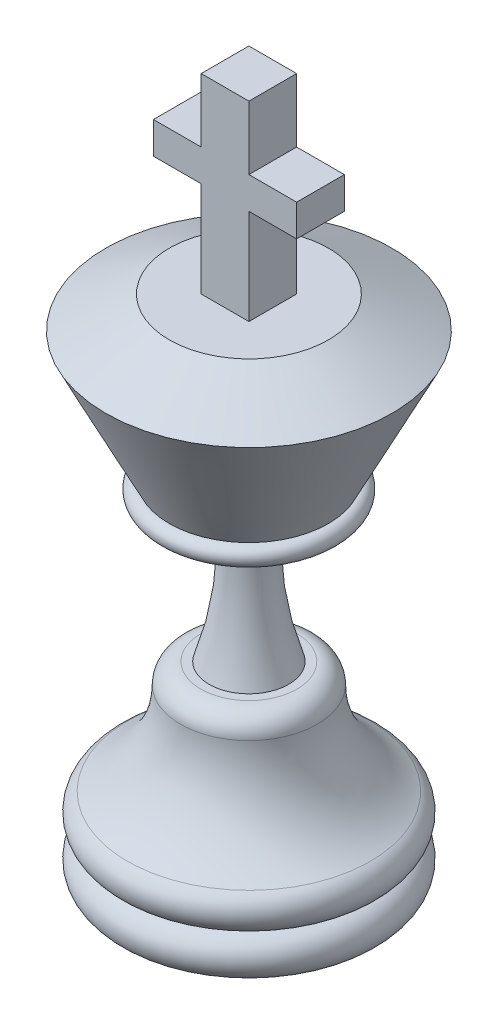
ISO-10303-21;
HEADER;
FILE_DESCRIPTION(('STEP AP214'),'2;1');
FILE_NAME('part.step','',(''),(''),'','','');
FILE_SCHEMA(('AUTOMOTIVE_DESIGN { 1 0 10303 214 1 1 1 1 }'));
ENDSEC;
DATA;
#1=APPLICATION_CONTEXT('core data for automotive mechanical design processes');
#2=APPLICATION_PROTOCOL_DEFINITION('international standard','automotive_design',2000,#1);
#3=PRODUCT_CONTEXT('',#1,'mechanical');
#4=PRODUCT('Part','Part','',(#3));
#5=PRODUCT_RELATED_PRODUCT_CATEGORY('part','',(#4));
#6=PRODUCT_DEFINITION_FORMATION('','',#4);
#7=PRODUCT_DEFINITION_CONTEXT('part definition',#1,'design');
#8=PRODUCT_DEFINITION('design','',#6,#7);
#9=PRODUCT_DEFINITION_SHAPE('','',#8);
#10=(LENGTH_UNIT() NAMED_UNIT(*) SI_UNIT(.MILLI.,.METRE.));
#11=(NAMED_UNIT(*) PLANE_ANGLE_UNIT() SI_UNIT($,.RADIAN.));
#12=(NAMED_UNIT(*) SI_UNIT($,.STERADIAN.) SOLID_ANGLE_UNIT());
#13=UNCERTAINTY_MEASURE_WITH_UNIT(LENGTH_MEASURE(1.E-05),#10,'distance_accuracy_value','');
#14=(GEOMETRIC_REPRESENTATION_CONTEXT(3) GLOBAL_UNCERTAINTY_ASSIGNED_CONTEXT((#13)) GLOBAL_UNIT_ASSIGNED_CONTEXT((#10,
#11,#12)) REPRESENTATION_CONTEXT('',''));
#15=CARTESIAN_POINT('',(0.,0.,0.));
#16=DIRECTION('',(0.,0.,1.));
#17=DIRECTION('',(1.,0.,0.));
#18=AXIS2_PLACEMENT_3D('',#15,#16,#17);
#19=CARTESIAN_POINT('',(0.,406.4,0.));
#20=DIRECTION('',(0.,-1.,0.));
#21=DIRECTION('',(0.,0.,-1.));
#22=AXIS2_PLACEMENT_3D('',#19,#20,#21);
#23=PLANE('',#22);
#24=CARTESIAN_POINT('',(0.,406.4,0.));
#25=DIRECTION('',(0.,1.,0.));
#26=DIRECTION('',(0.,0.,1.));
#27=AXIS2_PLACEMENT_3D('',#24,#25,#26);
#28=CIRCLE('',#27,63.5);
#29=CARTESIAN_POINT('',(0.,406.4,63.5));
#30=VERTEX_POINT('',#29);
#31=EDGE_CURVE('E146',#30,#30,#28,.T.);
#32=ORIENTED_EDGE('',*,*,#31,.T.);
#33=EDGE_LOOP('',(#32));
#34=FACE_BOUND('',#33,.T.);
#35=DIRECTION('',(1.,0.,0.));
#36=VECTOR('',#35,1.);
#37=CARTESIAN_POINT('',(-19.05,406.4,-19.05));
#38=LINE('',#37,#36);
#39=CARTESIAN_POINT('',(-19.05,406.4,-19.05));
#40=VERTEX_POINT('',#39);
#41=CARTESIAN_POINT('',(19.05,406.4,-19.05));
#42=VERTEX_POINT('',#41);
#43=EDGE_CURVE('E53',#40,#42,#38,.T.);
#44=ORIENTED_EDGE('',*,*,#43,.T.);
#45=DIRECTION('',(0.,0.,1.));
#46=VECTOR('',#45,1.);
#47=CARTESIAN_POINT('',(19.05,406.4,-19.05));
#48=LINE('',#47,#46);
#49=CARTESIAN_POINT('',(19.05,406.4,19.05));
#50=VERTEX_POINT('',#49);
#51=EDGE_CURVE('E126',#42,#50,#48,.T.);
#52=ORIENTED_EDGE('',*,*,#51,.T.);
#53=DIRECTION('',(1.,0.,0.));
#54=VECTOR('',#53,1.);
#55=CARTESIAN_POINT('',(-19.05,406.4,19.05));
#56=LINE('',#55,#54);
#57=CARTESIAN_POINT('',(-19.05,406.4,19.05));
#58=VERTEX_POINT('',#57);
#59=EDGE_CURVE('E131',#58,#50,#56,.T.);
#60=ORIENTED_EDGE('',*,*,#59,.F.);
#61=DIRECTION('',(0.,0.,1.));
#62=VECTOR('',#61,1.);
#63=CARTESIAN_POINT('',(-19.05,406.4,-19.05));
#64=LINE('',#63,#62);
#65=EDGE_CURVE('E150',#40,#58,#64,.T.);
#66=ORIENTED_EDGE('',*,*,#65,.F.);
#67=EDGE_LOOP('',(#44,#52,#60,#66));
#68=FACE_BOUND('',#67,.T.);
#69=ADVANCED_FACE('F30',(#34,#68),#23,.F.);
#70=CARTESIAN_POINT('',(0.,152.4,0.));
#71=DIRECTION('',(0.,1.,0.));
#72=DIRECTION('',(0.,0.,1.));
#73=AXIS2_PLACEMENT_3D('',#70,#71,#72);
#74=PLANE('',#73);
#75=CARTESIAN_POINT('',(0.,152.4,0.));
#76=DIRECTION('',(0.,-1.,0.));
#77=DIRECTION('',(0.,0.,-1.));
#78=AXIS2_PLACEMENT_3D('',#75,#76,#77);
#79=CIRCLE('',#78,31.7499999999999);
#80=CARTESIAN_POINT('',(0.,152.4,-31.7499999999999));
#81=VERTEX_POINT('',#80);
#82=EDGE_CURVE('E11',#81,#81,#79,.F.);
#83=ORIENTED_EDGE('',*,*,#82,.F.);
#84=EDGE_LOOP('',(#83));
#85=FACE_BOUND('',#84,.T.);
#86=CARTESIAN_POINT('',(0.,152.4,0.));
#87=DIRECTION('',(0.,-1.,0.));
#88=DIRECTION('',(0.,0.,-1.));
#89=AXIS2_PLACEMENT_3D('',#86,#87,#88);
#90=CIRCLE('',#89,38.350818771168);
#91=CARTESIAN_POINT('',(0.,152.4,-38.350818771168));
#92=VERTEX_POINT('',#91);
#93=EDGE_CURVE('E38',#92,#92,#90,.T.);
#94=ORIENTED_EDGE('',*,*,#93,.F.);
#95=EDGE_LOOP('',(#94));
#96=FACE_BOUND('',#95,.T.);
#97=ADVANCED_FACE('F32',(#85,#96),#74,.T.);
#98=CARTESIAN_POINT('',(0.,136.188437542336,0.));
#99=DIRECTION('',(0.,-1.,0.));
#100=DIRECTION('',(0.,0.,-1.));
#101=AXIS2_PLACEMENT_3D('',#98,#99,#100);
#102=TOROIDAL_SURFACE('',#101,38.350818771168,16.211562457664);
#103=ORIENTED_EDGE('',*,*,#93,.T.);
#104=EDGE_LOOP('',(#103));
#105=FACE_BOUND('',#104,.T.);
#106=CARTESIAN_POINT('',(0.,136.188437542336,0.));
#107=DIRECTION('',(0.,-1.,0.));
#108=DIRECTION('',(0.,0.,-1.));
#109=AXIS2_PLACEMENT_3D('',#106,#107,#108);
#110=CIRCLE('',#109,54.562381228832);
#111=CARTESIAN_POINT('',(0.,136.188437542336,-54.562381228832));
#112=VERTEX_POINT('',#111);
#113=EDGE_CURVE('E171',#112,#112,#110,.T.);
#114=ORIENTED_EDGE('',*,*,#113,.F.);
#115=EDGE_LOOP('',(#114));
#116=FACE_BOUND('',#115,.T.);
#117=ADVANCED_FACE('F176',(#105,#116),#102,.T.);
#118=CARTESIAN_POINT('',(0.,136.188437542336,0.));
#119=DIRECTION('',(0.,-1.,0.));
#120=DIRECTION('',(0.,0.,-1.));
#121=AXIS2_PLACEMENT_3D('',#118,#119,#120);
#122=TOROIDAL_SURFACE('',#121,139.449181228832,84.8868);
#123=ORIENTED_EDGE('',*,*,#113,.T.);
#124=EDGE_LOOP('',(#123));
#125=FACE_BOUND('',#124,.T.);
#126=CARTESIAN_POINT('',(0.,62.6743122963664,0.));
#127=DIRECTION('',(0.,-1.,0.));
#128=DIRECTION('',(0.,0.,-1.));
#129=AXIS2_PLACEMENT_3D('',#126,#127,#128);
#130=CIRCLE('',#129,97.0057812288332);
#131=CARTESIAN_POINT('',(0.,62.6743122963664,-97.0057812288332));
#132=VERTEX_POINT('',#131);
#133=EDGE_CURVE('E168',#132,#132,#130,.T.);
#134=ORIENTED_EDGE('',*,*,#133,.F.);
#135=EDGE_LOOP('',(#134));
#136=FACE_BOUND('',#135,.T.);
#137=ADVANCED_FACE('F185',(#125,#136),#122,.F.);
#138=CARTESIAN_POINT('',(0.,48.634687372992,0.));
#139=DIRECTION('',(0.,-1.,0.));
#140=DIRECTION('',(0.,0.,-1.));
#141=AXIS2_PLACEMENT_3D('',#138,#139,#140);
#142=TOROIDAL_SURFACE('',#141,88.9,16.211562457664);
#143=ORIENTED_EDGE('',*,*,#133,.T.);
#144=EDGE_LOOP('',(#143));
#145=FACE_BOUND('',#144,.T.);
#146=CARTESIAN_POINT('',(0.,32.423124915328,0.));
#147=DIRECTION('',(0.,-1.,0.));
#148=DIRECTION('',(0.,0.,-1.));
#149=AXIS2_PLACEMENT_3D('',#146,#147,#148);
#150=CIRCLE('',#149,88.9);
#151=CARTESIAN_POINT('',(0.,32.423124915328,-88.9));
#152=VERTEX_POINT('',#151);
#153=EDGE_CURVE('E165',#152,#152,#150,.T.);
#154=ORIENTED_EDGE('',*,*,#153,.F.);
#155=EDGE_LOOP('',(#154));
#156=FACE_BOUND('',#155,.T.);
#157=ADVANCED_FACE('F210',(#145,#156),#142,.T.);
#158=CARTESIAN_POINT('',(0.,16.211562457664,0.));
#159=DIRECTION('',(0.,-1.,0.));
#160=DIRECTION('',(0.,0.,-1.));
#161=AXIS2_PLACEMENT_3D('',#158,#159,#160);
#162=TOROIDAL_SURFACE('',#161,88.9,16.211562457664);
#163=ORIENTED_EDGE('',*,*,#153,.T.);
#164=EDGE_LOOP('',(#163));
#165=FACE_BOUND('',#164,.T.);
#166=CARTESIAN_POINT('',(0.,0.,0.));
#167=DIRECTION('',(0.,-1.,0.));
#168=DIRECTION('',(0.,0.,-1.));
#169=AXIS2_PLACEMENT_3D('',#166,#167,#168);
#170=CIRCLE('',#169,88.9);
#171=CARTESIAN_POINT('',(0.,0.,-88.9));
#172=VERTEX_POINT('',#171);
#173=EDGE_CURVE('E162',#172,#172,#170,.T.);
#174=ORIENTED_EDGE('',*,*,#173,.F.);
#175=EDGE_LOOP('',(#174));
#176=FACE_BOUND('',#175,.T.);
#177=ADVANCED_FACE('F203',(#165,#176),#162,.T.);
#178=CARTESIAN_POINT('',(0.,0.,0.));
#179=DIRECTION('',(0.,-1.,0.));
#180=DIRECTION('',(0.,0.,-1.));
#181=AXIS2_PLACEMENT_3D('',#178,#179,#180);
#182=PLANE('',#181);
#183=ORIENTED_EDGE('',*,*,#173,.T.);
#184=EDGE_LOOP('',(#183));
#185=FACE_BOUND('',#184,.T.);
#186=ADVANCED_FACE('F193',(#185),#182,.T.);
#187=CARTESIAN_POINT('',(0.,234.043312784872,0.));
#188=DIRECTION('',(0.,-1.,0.));
#189=DIRECTION('',(0.,0.,-1.));
#190=AXIS2_PLACEMENT_3D('',#187,#188,#189);
#191=TOROIDAL_SURFACE('',#190,272.271037494668,254.);
#192=CARTESIAN_POINT('',(0.,253.920590519107,0.));
#193=DIRECTION('',(0.,-1.,0.));
#194=DIRECTION('',(0.,0.,-1.));
#195=AXIS2_PLACEMENT_3D('',#192,#193,#194);
#196=CIRCLE('',#195,19.05);
#197=CARTESIAN_POINT('',(0.,253.920590519107,-19.05));
#198=VERTEX_POINT('',#197);
#199=EDGE_CURVE('E159',#198,#198,#196,.T.);
#200=ORIENTED_EDGE('',*,*,#199,.T.);
#201=EDGE_LOOP('',(#200));
#202=FACE_BOUND('',#201,.T.);
#203=ORIENTED_EDGE('',*,*,#82,.T.);
#204=EDGE_LOOP('',(#203));
#205=FACE_BOUND('',#204,.T.);
#206=ADVANCED_FACE('F190',(#202,#205),#191,.F.);
#207=CARTESIAN_POINT('',(0.,162.56,0.));
#208=DIRECTION('',(0.,-1.,0.));
#209=DIRECTION('',(0.,0.,-1.));
#210=AXIS2_PLACEMENT_3D('',#207,#208,#209);
#211=DEGENERATE_TOROIDAL_SURFACE('',#210,63.5,101.6,.T.);
#212=CARTESIAN_POINT('',(0.,264.16,0.));
#213=DIRECTION('',(0.,-1.,0.));
#214=DIRECTION('',(0.,0.,-1.));
#215=AXIS2_PLACEMENT_3D('',#212,#213,#214);
#216=CIRCLE('',#215,63.5);
#217=CARTESIAN_POINT('',(0.,264.16,-63.5));
#218=VERTEX_POINT('',#217);
#219=EDGE_CURVE('E156',#218,#218,#216,.T.);
#220=ORIENTED_EDGE('',*,*,#219,.T.);
#221=EDGE_LOOP('',(#220));
#222=FACE_BOUND('',#221,.T.);
#223=ORIENTED_EDGE('',*,*,#199,.F.);
#224=EDGE_LOOP('',(#223));
#225=FACE_BOUND('',#224,.T.);
#226=ADVANCED_FACE('F192',(#222,#225),#211,.F.);
#227=CARTESIAN_POINT('',(0.,271.78,0.));
#228=DIRECTION('',(0.,-1.,0.));
#229=DIRECTION('',(0.,0.,-1.));
#230=AXIS2_PLACEMENT_3D('',#227,#228,#229);
#231=TOROIDAL_SURFACE('',#230,63.5,7.62000000000004);
#232=CARTESIAN_POINT('',(0.,279.4,0.));
#233=DIRECTION('',(0.,1.,0.));
#234=DIRECTION('',(0.,0.,1.));
#235=AXIS2_PLACEMENT_3D('',#232,#233,#234);
#236=CIRCLE('',#235,63.5);
#237=CARTESIAN_POINT('',(0.,279.4,63.5));
#238=VERTEX_POINT('',#237);
#239=EDGE_CURVE('E153',#238,#238,#236,.T.);
#240=ORIENTED_EDGE('',*,*,#239,.F.);
#241=EDGE_LOOP('',(#240));
#242=FACE_BOUND('',#241,.T.);
#243=ORIENTED_EDGE('',*,*,#219,.F.);
#244=EDGE_LOOP('',(#243));
#245=FACE_BOUND('',#244,.T.);
#246=ADVANCED_FACE('F200',(#242,#245),#231,.T.);
#247=CARTESIAN_POINT('',(0.,279.4,0.));
#248=DIRECTION('',(0.,1.,0.));
#249=DIRECTION('',(0.,0.,1.));
#250=AXIS2_PLACEMENT_3D('',#247,#248,#249);
#251=CONICAL_SURFACE('',#250,63.5,0.463647609000807);
#252=CARTESIAN_POINT('',(0.,381.,0.));
#253=DIRECTION('',(0.,1.,0.));
#254=DIRECTION('',(0.,0.,1.));
#255=AXIS2_PLACEMENT_3D('',#252,#253,#254);
#256=CIRCLE('',#255,114.3);
#257=CARTESIAN_POINT('',(0.,381.,114.3));
#258=VERTEX_POINT('',#257);
#259=EDGE_CURVE('E149',#258,#258,#256,.T.);
#260=ORIENTED_EDGE('',*,*,#259,.F.);
#261=EDGE_LOOP('',(#260));
#262=FACE_BOUND('',#261,.T.);
#263=ORIENTED_EDGE('',*,*,#239,.T.);
#264=EDGE_LOOP('',(#263));
#265=FACE_BOUND('',#264,.T.);
#266=ADVANCED_FACE('F264',(#262,#265),#251,.T.);
#267=CARTESIAN_POINT('',(0.,381.,0.));
#268=DIRECTION('',(0.,-1.,0.));
#269=DIRECTION('',(0.,0.,-1.));
#270=AXIS2_PLACEMENT_3D('',#267,#268,#269);
#271=CONICAL_SURFACE('',#270,114.3,1.10714871779409);
#272=ORIENTED_EDGE('',*,*,#31,.F.);
#273=EDGE_LOOP('',(#272));
#274=FACE_BOUND('',#273,.T.);
#275=ORIENTED_EDGE('',*,*,#259,.T.);
#276=EDGE_LOOP('',(#275));
#277=FACE_BOUND('',#276,.T.);
#278=ADVANCED_FACE('F273',(#274,#277),#271,.T.);
#279=CARTESIAN_POINT('',(-19.05,406.4,-19.05));
#280=DIRECTION('',(-1.,0.,0.));
#281=DIRECTION('',(0.,-1.,0.));
#282=AXIS2_PLACEMENT_3D('',#279,#280,#281);
#283=PLANE('',#282);
#284=ORIENTED_EDGE('',*,*,#65,.T.);
#285=DIRECTION('',(0.,-1.,0.));
#286=VECTOR('',#285,1.);
#287=CARTESIAN_POINT('',(-19.05,406.4,19.05));
#288=LINE('',#287,#286);
#289=CARTESIAN_POINT('',(-19.05,482.6,19.05));
#290=VERTEX_POINT('',#289);
#291=EDGE_CURVE('E45',#290,#58,#288,.T.);
#292=ORIENTED_EDGE('',*,*,#291,.F.);
#293=DIRECTION('',(0.,0.,1.));
#294=VECTOR('',#293,1.);
#295=CARTESIAN_POINT('',(-19.05,482.6,-19.05));
#296=LINE('',#295,#294);
#297=CARTESIAN_POINT('',(-19.05,482.6,-19.05));
#298=VERTEX_POINT('',#297);
#299=EDGE_CURVE('E479',#298,#290,#296,.T.);
#300=ORIENTED_EDGE('',*,*,#299,.F.);
#301=DIRECTION('',(0.,-1.,0.));
#302=VECTOR('',#301,1.);
#303=CARTESIAN_POINT('',(-19.05,406.4,-19.05));
#304=LINE('',#303,#302);
#305=EDGE_CURVE('E138',#298,#40,#304,.T.);
#306=ORIENTED_EDGE('',*,*,#305,.T.);
#307=EDGE_LOOP('',(#284,#292,#300,#306));
#308=FACE_BOUND('',#307,.T.);
#309=ADVANCED_FACE('F283',(#308),#283,.T.);
#310=CARTESIAN_POINT('',(-19.05,482.6,-19.05));
#311=DIRECTION('',(0.,-1.,0.));
#312=DIRECTION('',(1.,0.,0.));
#313=AXIS2_PLACEMENT_3D('',#310,#311,#312);
#314=PLANE('',#313);
#315=ORIENTED_EDGE('',*,*,#299,.T.);
#316=DIRECTION('',(1.,0.,0.));
#317=VECTOR('',#316,1.);
#318=CARTESIAN_POINT('',(-19.05,482.6,19.05));
#319=LINE('',#318,#317);
#320=CARTESIAN_POINT('',(-57.15,482.6,19.05));
#321=VERTEX_POINT('',#320);
#322=EDGE_CURVE('E449',#321,#290,#319,.T.);
#323=ORIENTED_EDGE('',*,*,#322,.F.);
#324=DIRECTION('',(0.,0.,1.));
#325=VECTOR('',#324,1.);
#326=CARTESIAN_POINT('',(-57.15,482.6,-19.05));
#327=LINE('',#326,#325);
#328=CARTESIAN_POINT('',(-57.15,482.6,-19.05));
#329=VERTEX_POINT('',#328);
#330=EDGE_CURVE('E481',#329,#321,#327,.T.);
#331=ORIENTED_EDGE('',*,*,#330,.F.);
#332=DIRECTION('',(1.,0.,0.));
#333=VECTOR('',#332,1.);
#334=CARTESIAN_POINT('',(-19.05,482.6,-19.05));
#335=LINE('',#334,#333);
#336=EDGE_CURVE('E142',#329,#298,#335,.T.);
#337=ORIENTED_EDGE('',*,*,#336,.T.);
#338=EDGE_LOOP('',(#315,#323,#331,#337));
#339=FACE_BOUND('',#338,.T.);
#340=ADVANCED_FACE('F299',(#339),#314,.T.);
#341=CARTESIAN_POINT('',(-57.15,482.6,-19.05));
#342=DIRECTION('',(-1.,0.,0.));
#343=DIRECTION('',(0.,-1.,0.));
#344=AXIS2_PLACEMENT_3D('',#341,#342,#343);
#345=PLANE('',#344);
#346=ORIENTED_EDGE('',*,*,#330,.T.);
#347=DIRECTION('',(0.,-1.,0.));
#348=VECTOR('',#347,1.);
#349=CARTESIAN_POINT('',(-57.15,482.6,19.05));
#350=LINE('',#349,#348);
#351=CARTESIAN_POINT('',(-57.15,508.,19.05));
#352=VERTEX_POINT('',#351);
#353=EDGE_CURVE('E446',#352,#321,#350,.T.);
#354=ORIENTED_EDGE('',*,*,#353,.F.);
#355=DIRECTION('',(0.,0.,1.));
#356=VECTOR('',#355,1.);
#357=CARTESIAN_POINT('',(-57.15,508.,-19.05));
#358=LINE('',#357,#356);
#359=CARTESIAN_POINT('',(-57.15,508.,-19.05));
#360=VERTEX_POINT('',#359);
#361=EDGE_CURVE('E483',#360,#352,#358,.T.);
#362=ORIENTED_EDGE('',*,*,#361,.F.);
#363=DIRECTION('',(0.,-1.,0.));
#364=VECTOR('',#363,1.);
#365=CARTESIAN_POINT('',(-57.15,482.6,-19.05));
#366=LINE('',#365,#364);
#367=EDGE_CURVE('E473',#360,#329,#366,.T.);
#368=ORIENTED_EDGE('',*,*,#367,.T.);
#369=EDGE_LOOP('',(#346,#354,#362,#368));
#370=FACE_BOUND('',#369,.T.);
#371=ADVANCED_FACE('F309',(#370),#345,.T.);
#372=CARTESIAN_POINT('',(-57.15,508.,-19.05));
#373=DIRECTION('',(0.,1.,0.));
#374=DIRECTION('',(0.,0.,1.));
#375=AXIS2_PLACEMENT_3D('',#372,#373,#374);
#376=PLANE('',#375);
#377=ORIENTED_EDGE('',*,*,#361,.T.);
#378=DIRECTION('',(-1.,0.,0.));
#379=VECTOR('',#378,1.);
#380=CARTESIAN_POINT('',(-57.15,508.,19.05));
#381=LINE('',#380,#379);
#382=CARTESIAN_POINT('',(-19.05,508.,19.05));
#383=VERTEX_POINT('',#382);
#384=EDGE_CURVE('E443',#383,#352,#381,.T.);
#385=ORIENTED_EDGE('',*,*,#384,.F.);
#386=DIRECTION('',(0.,0.,1.));
#387=VECTOR('',#386,1.);
#388=CARTESIAN_POINT('',(-19.05,508.,-19.05));
#389=LINE('',#388,#387);
#390=CARTESIAN_POINT('',(-19.05,508.,-19.05));
#391=VERTEX_POINT('',#390);
#392=EDGE_CURVE('E485',#391,#383,#389,.T.);
#393=ORIENTED_EDGE('',*,*,#392,.F.);
#394=DIRECTION('',(-1.,0.,0.));
#395=VECTOR('',#394,1.);
#396=CARTESIAN_POINT('',(-57.15,508.,-19.05));
#397=LINE('',#396,#395);
#398=EDGE_CURVE('E470',#391,#360,#397,.T.);
#399=ORIENTED_EDGE('',*,*,#398,.T.);
#400=EDGE_LOOP('',(#377,#385,#393,#399));
#401=FACE_BOUND('',#400,.T.);
#402=ADVANCED_FACE('F319',(#401),#376,.T.);
#403=CARTESIAN_POINT('',(-19.05,508.,-19.05));
#404=DIRECTION('',(-1.,0.,0.));
#405=DIRECTION('',(0.,-1.,0.));
#406=AXIS2_PLACEMENT_3D('',#403,#404,#405);
#407=PLANE('',#406);
#408=ORIENTED_EDGE('',*,*,#392,.T.);
#409=DIRECTION('',(0.,-1.,0.));
#410=VECTOR('',#409,1.);
#411=CARTESIAN_POINT('',(-19.05,508.,19.05));
#412=LINE('',#411,#410);
#413=CARTESIAN_POINT('',(-19.05,558.8,19.05));
#414=VERTEX_POINT('',#413);
#415=EDGE_CURVE('E440',#414,#383,#412,.T.);
#416=ORIENTED_EDGE('',*,*,#415,.F.);
#417=DIRECTION('',(0.,0.,1.));
#418=VECTOR('',#417,1.);
#419=CARTESIAN_POINT('',(-19.05,558.8,-19.05));
#420=LINE('',#419,#418);
#421=CARTESIAN_POINT('',(-19.05,558.8,-19.05));
#422=VERTEX_POINT('',#421);
#423=EDGE_CURVE('E487',#422,#414,#420,.T.);
#424=ORIENTED_EDGE('',*,*,#423,.F.);
#425=DIRECTION('',(0.,-1.,0.));
#426=VECTOR('',#425,1.);
#427=CARTESIAN_POINT('',(-19.05,508.,-19.05));
#428=LINE('',#427,#426);
#429=EDGE_CURVE('E467',#422,#391,#428,.T.);
#430=ORIENTED_EDGE('',*,*,#429,.T.);
#431=EDGE_LOOP('',(#408,#416,#424,#430));
#432=FACE_BOUND('',#431,.T.);
#433=ADVANCED_FACE('F329',(#432),#407,.T.);
#434=CARTESIAN_POINT('',(19.05,558.8,-19.05));
#435=DIRECTION('',(0.,1.,0.));
#436=DIRECTION('',(0.,0.,1.));
#437=AXIS2_PLACEMENT_3D('',#434,#435,#436);
#438=PLANE('',#437);
#439=ORIENTED_EDGE('',*,*,#423,.T.);
#440=DIRECTION('',(-1.,0.,0.));
#441=VECTOR('',#440,1.);
#442=CARTESIAN_POINT('',(19.05,558.8,19.05));
#443=LINE('',#442,#441);
#444=CARTESIAN_POINT('',(19.05,558.8,19.05));
#445=VERTEX_POINT('',#444);
#446=EDGE_CURVE('E437',#445,#414,#443,.T.);
#447=ORIENTED_EDGE('',*,*,#446,.F.);
#448=DIRECTION('',(0.,0.,1.));
#449=VECTOR('',#448,1.);
#450=CARTESIAN_POINT('',(19.05,558.8,-19.05));
#451=LINE('',#450,#449);
#452=CARTESIAN_POINT('',(19.05,558.8,-19.05));
#453=VERTEX_POINT('',#452);
#454=EDGE_CURVE('E489',#453,#445,#451,.T.);
#455=ORIENTED_EDGE('',*,*,#454,.F.);
#456=DIRECTION('',(-1.,0.,0.));
#457=VECTOR('',#456,1.);
#458=CARTESIAN_POINT('',(19.05,558.8,-19.05));
#459=LINE('',#458,#457);
#460=EDGE_CURVE('E464',#453,#422,#459,.T.);
#461=ORIENTED_EDGE('',*,*,#460,.T.);
#462=EDGE_LOOP('',(#439,#447,#455,#461));
#463=FACE_BOUND('',#462,.T.);
#464=ADVANCED_FACE('F339',(#463),#438,.T.);
#465=CARTESIAN_POINT('',(19.05,508.,-19.05));
#466=DIRECTION('',(1.,0.,0.));
#467=DIRECTION('',(0.,0.,-1.));
#468=AXIS2_PLACEMENT_3D('',#465,#466,#467);
#469=PLANE('',#468);
#470=ORIENTED_EDGE('',*,*,#454,.T.);
#471=DIRECTION('',(0.,1.,0.));
#472=VECTOR('',#471,1.);
#473=CARTESIAN_POINT('',(19.05,508.,19.05));
#474=LINE('',#473,#472);
#475=CARTESIAN_POINT('',(19.05,508.,19.05));
#476=VERTEX_POINT('',#475);
#477=EDGE_CURVE('E432',#476,#445,#474,.T.);
#478=ORIENTED_EDGE('',*,*,#477,.F.);
#479=DIRECTION('',(0.,0.,1.));
#480=VECTOR('',#479,1.);
#481=CARTESIAN_POINT('',(19.05,508.,-19.05));
#482=LINE('',#481,#480);
#483=CARTESIAN_POINT('',(19.05,508.,-19.05));
#484=VERTEX_POINT('',#483);
#485=EDGE_CURVE('E491',#484,#476,#482,.T.);
#486=ORIENTED_EDGE('',*,*,#485,.F.);
#487=DIRECTION('',(0.,1.,0.));
#488=VECTOR('',#487,1.);
#489=CARTESIAN_POINT('',(19.05,508.,-19.05));
#490=LINE('',#489,#488);
#491=EDGE_CURVE('E461',#484,#453,#490,.T.);
#492=ORIENTED_EDGE('',*,*,#491,.T.);
#493=EDGE_LOOP('',(#470,#478,#486,#492));
#494=FACE_BOUND('',#493,.T.);
#495=ADVANCED_FACE('F349',(#494),#469,.T.);
#496=CARTESIAN_POINT('',(57.15,508.,-19.05));
#497=DIRECTION('',(0.,1.,0.));
#498=DIRECTION('',(0.,0.,1.));
#499=AXIS2_PLACEMENT_3D('',#496,#497,#498);
#500=PLANE('',#499);
#501=ORIENTED_EDGE('',*,*,#485,.T.);
#502=DIRECTION('',(-1.,0.,0.));
#503=VECTOR('',#502,1.);
#504=CARTESIAN_POINT('',(57.15,508.,19.05));
#505=LINE('',#504,#503);
#506=CARTESIAN_POINT('',(57.15,508.,19.05));
#507=VERTEX_POINT('',#506);
#508=EDGE_CURVE('E430',#507,#476,#505,.T.);
#509=ORIENTED_EDGE('',*,*,#508,.F.);
#510=DIRECTION('',(0.,0.,1.));
#511=VECTOR('',#510,1.);
#512=CARTESIAN_POINT('',(57.15,508.,-19.05));
#513=LINE('',#512,#511);
#514=CARTESIAN_POINT('',(57.15,508.,-19.05));
#515=VERTEX_POINT('',#514);
#516=EDGE_CURVE('E424',#515,#507,#513,.T.);
#517=ORIENTED_EDGE('',*,*,#516,.F.);
#518=DIRECTION('',(-1.,0.,0.));
#519=VECTOR('',#518,1.);
#520=CARTESIAN_POINT('',(57.15,508.,-19.05));
#521=LINE('',#520,#519);
#522=EDGE_CURVE('E458',#515,#484,#521,.T.);
#523=ORIENTED_EDGE('',*,*,#522,.T.);
#524=EDGE_LOOP('',(#501,#509,#517,#523));
#525=FACE_BOUND('',#524,.T.);
#526=ADVANCED_FACE('F359',(#525),#500,.T.);
#527=CARTESIAN_POINT('',(57.15,482.6,-19.05));
#528=DIRECTION('',(1.,0.,0.));
#529=DIRECTION('',(0.,0.,-1.));
#530=AXIS2_PLACEMENT_3D('',#527,#528,#529);
#531=PLANE('',#530);
#532=ORIENTED_EDGE('',*,*,#516,.T.);
#533=DIRECTION('',(0.,1.,0.));
#534=VECTOR('',#533,1.);
#535=CARTESIAN_POINT('',(57.15,482.6,19.05));
#536=LINE('',#535,#534);
#537=CARTESIAN_POINT('',(57.15,482.6,19.05));
#538=VERTEX_POINT('',#537);
#539=EDGE_CURVE('E427',#538,#507,#536,.T.);
#540=ORIENTED_EDGE('',*,*,#539,.F.);
#541=DIRECTION('',(0.,0.,1.));
#542=VECTOR('',#541,1.);
#543=CARTESIAN_POINT('',(57.15,482.6,-19.05));
#544=LINE('',#543,#542);
#545=CARTESIAN_POINT('',(57.15,482.6,-19.05));
#546=VERTEX_POINT('',#545);
#547=EDGE_CURVE('E140',#546,#538,#544,.T.);
#548=ORIENTED_EDGE('',*,*,#547,.F.);
#549=DIRECTION('',(0.,1.,0.));
#550=VECTOR('',#549,1.);
#551=CARTESIAN_POINT('',(57.15,482.6,-19.05));
#552=LINE('',#551,#550);
#553=EDGE_CURVE('E456',#546,#515,#552,.T.);
#554=ORIENTED_EDGE('',*,*,#553,.T.);
#555=EDGE_LOOP('',(#532,#540,#548,#554));
#556=FACE_BOUND('',#555,.T.);
#557=ADVANCED_FACE('F369',(#556),#531,.T.);
#558=CARTESIAN_POINT('',(19.05,482.6,-19.05));
#559=DIRECTION('',(0.,-1.,0.));
#560=DIRECTION('',(0.,0.,-1.));
#561=AXIS2_PLACEMENT_3D('',#558,#559,#560);
#562=PLANE('',#561);
#563=ORIENTED_EDGE('',*,*,#547,.T.);
#564=DIRECTION('',(1.,0.,0.));
#565=VECTOR('',#564,1.);
#566=CARTESIAN_POINT('',(19.05,482.6,19.05));
#567=LINE('',#566,#565);
#568=CARTESIAN_POINT('',(19.05,482.6,19.05));
#569=VERTEX_POINT('',#568);
#570=EDGE_CURVE('E130',#569,#538,#567,.T.);
#571=ORIENTED_EDGE('',*,*,#570,.F.);
#572=DIRECTION('',(0.,0.,1.));
#573=VECTOR('',#572,1.);
#574=CARTESIAN_POINT('',(19.05,482.6,-19.05));
#575=LINE('',#574,#573);
#576=CARTESIAN_POINT('',(19.05,482.6,-19.05));
#577=VERTEX_POINT('',#576);
#578=EDGE_CURVE('E127',#577,#569,#575,.T.);
#579=ORIENTED_EDGE('',*,*,#578,.F.);
#580=DIRECTION('',(1.,0.,0.));
#581=VECTOR('',#580,1.);
#582=CARTESIAN_POINT('',(19.05,482.6,-19.05));
#583=LINE('',#582,#581);
#584=EDGE_CURVE('E420',#577,#546,#583,.T.);
#585=ORIENTED_EDGE('',*,*,#584,.T.);
#586=EDGE_LOOP('',(#563,#571,#579,#585));
#587=FACE_BOUND('',#586,.T.);
#588=ADVANCED_FACE('F379',(#587),#562,.T.);
#589=CARTESIAN_POINT('',(19.05,406.4,-19.05));
#590=DIRECTION('',(1.,0.,0.));
#591=DIRECTION('',(0.,0.,-1.));
#592=AXIS2_PLACEMENT_3D('',#589,#590,#591);
#593=PLANE('',#592);
#594=ORIENTED_EDGE('',*,*,#578,.T.);
#595=DIRECTION('',(0.,1.,0.));
#596=VECTOR('',#595,1.);
#597=CARTESIAN_POINT('',(19.05,406.4,19.05));
#598=LINE('',#597,#596);
#599=EDGE_CURVE('E122',#50,#569,#598,.T.);
#600=ORIENTED_EDGE('',*,*,#599,.F.);
#601=ORIENTED_EDGE('',*,*,#51,.F.);
#602=DIRECTION('',(0.,1.,0.));
#603=VECTOR('',#602,1.);
#604=CARTESIAN_POINT('',(19.05,406.4,-19.05));
#605=LINE('',#604,#603);
#606=EDGE_CURVE('E453',#42,#577,#605,.T.);
#607=ORIENTED_EDGE('',*,*,#606,.T.);
#608=EDGE_LOOP('',(#594,#600,#601,#607));
#609=FACE_BOUND('',#608,.T.);
#610=ADVANCED_FACE('F123',(#609),#593,.T.);
#611=CARTESIAN_POINT('',(19.05,406.4,-19.05));
#612=DIRECTION('',(0.,0.,1.));
#613=DIRECTION('',(1.,0.,0.));
#614=AXIS2_PLACEMENT_3D('',#611,#612,#613);
#615=PLANE('',#614);
#616=ORIENTED_EDGE('',*,*,#43,.F.);
#617=ORIENTED_EDGE('',*,*,#305,.F.);
#618=ORIENTED_EDGE('',*,*,#336,.F.);
#619=ORIENTED_EDGE('',*,*,#367,.F.);
#620=ORIENTED_EDGE('',*,*,#398,.F.);
#621=ORIENTED_EDGE('',*,*,#429,.F.);
#622=ORIENTED_EDGE('',*,*,#460,.F.);
#623=ORIENTED_EDGE('',*,*,#491,.F.);
#624=ORIENTED_EDGE('',*,*,#522,.F.);
#625=ORIENTED_EDGE('',*,*,#553,.F.);
#626=ORIENTED_EDGE('',*,*,#584,.F.);
#627=ORIENTED_EDGE('',*,*,#606,.F.);
#628=EDGE_LOOP('',(#616,#617,#618,#619,#620,#621,#622,#623,#624,#625,#626,#627));
#629=FACE_BOUND('',#628,.T.);
#630=ADVANCED_FACE('F398',(#629),#615,.F.);
#631=CARTESIAN_POINT('',(19.05,406.4,19.05));
#632=DIRECTION('',(0.,0.,1.));
#633=DIRECTION('',(1.,0.,0.));
#634=AXIS2_PLACEMENT_3D('',#631,#632,#633);
#635=PLANE('',#634);
#636=ORIENTED_EDGE('',*,*,#59,.T.);
#637=ORIENTED_EDGE('',*,*,#599,.T.);
#638=ORIENTED_EDGE('',*,*,#570,.T.);
#639=ORIENTED_EDGE('',*,*,#539,.T.);
#640=ORIENTED_EDGE('',*,*,#508,.T.);
#641=ORIENTED_EDGE('',*,*,#477,.T.);
#642=ORIENTED_EDGE('',*,*,#446,.T.);
#643=ORIENTED_EDGE('',*,*,#415,.T.);
#644=ORIENTED_EDGE('',*,*,#384,.T.);
#645=ORIENTED_EDGE('',*,*,#353,.T.);
#646=ORIENTED_EDGE('',*,*,#322,.T.);
#647=ORIENTED_EDGE('',*,*,#291,.T.);
#648=EDGE_LOOP('',(#636,#637,#638,#639,#640,#641,#642,#643,#644,#645,#646,#647));
#649=FACE_BOUND('',#648,.T.);
#650=ADVANCED_FACE('F134',(#649),#635,.T.);
#651=CLOSED_SHELL('',(#69,#97,#117,#137,#157,#177,#186,#206,#226,#246,#266,#278,#309,#340,#371,
#402,#433,#464,#495,#526,#557,#588,#610,#630,#650));
#652=MANIFOLD_SOLID_BREP('B2',#651);
#653=ADVANCED_BREP_SHAPE_REPRESENTATION('',(#18,#652),#14);
#654=SHAPE_DEFINITION_REPRESENTATION(#9,#653);
ENDSEC;
END-ISO-10303-21;
